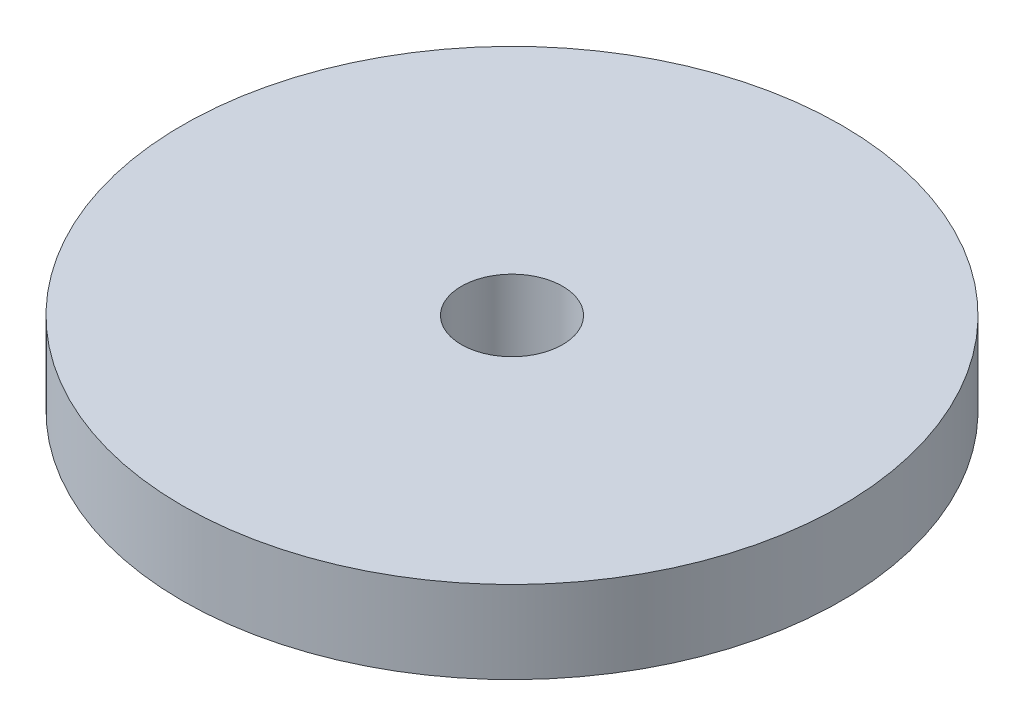
ISO-10303-21;
HEADER;
FILE_DESCRIPTION(('STEP AP214'),'2;1');
FILE_NAME('part.step','',(''),(''),'','','');
FILE_SCHEMA(('AUTOMOTIVE_DESIGN { 1 0 10303 214 1 1 1 1 }'));
ENDSEC;
DATA;
#1=APPLICATION_CONTEXT('core data for automotive mechanical design processes');
#2=APPLICATION_PROTOCOL_DEFINITION('international standard','automotive_design',2000,#1);
#3=PRODUCT_CONTEXT('',#1,'mechanical');
#4=PRODUCT('Part','Part','',(#3));
#5=PRODUCT_RELATED_PRODUCT_CATEGORY('part','',(#4));
#6=PRODUCT_DEFINITION_FORMATION('','',#4);
#7=PRODUCT_DEFINITION_CONTEXT('part definition',#1,'design');
#8=PRODUCT_DEFINITION('design','',#6,#7);
#9=PRODUCT_DEFINITION_SHAPE('','',#8);
#10=(LENGTH_UNIT() NAMED_UNIT(*) SI_UNIT(.MILLI.,.METRE.));
#11=(NAMED_UNIT(*) PLANE_ANGLE_UNIT() SI_UNIT($,.RADIAN.));
#12=(NAMED_UNIT(*) SI_UNIT($,.STERADIAN.) SOLID_ANGLE_UNIT());
#13=UNCERTAINTY_MEASURE_WITH_UNIT(LENGTH_MEASURE(1.E-05),#10,'distance_accuracy_value','');
#14=(GEOMETRIC_REPRESENTATION_CONTEXT(3) GLOBAL_UNCERTAINTY_ASSIGNED_CONTEXT((#13)) GLOBAL_UNIT_ASSIGNED_CONTEXT((#10,
#11,#12)) REPRESENTATION_CONTEXT('',''));
#15=CARTESIAN_POINT('',(0.,0.,0.));
#16=DIRECTION('',(0.,0.,1.));
#17=DIRECTION('',(1.,0.,0.));
#18=AXIS2_PLACEMENT_3D('',#15,#16,#17);
#19=CARTESIAN_POINT('',(0.,4.,0.));
#20=DIRECTION('',(0.,-1.,0.));
#21=DIRECTION('',(0.,0.,-1.));
#22=AXIS2_PLACEMENT_3D('',#19,#20,#21);
#23=CYLINDRICAL_SURFACE('',#22,14.);
#24=CARTESIAN_POINT('',(0.,4.,0.));
#25=DIRECTION('',(0.,1.,0.));
#26=DIRECTION('',(0.,0.,1.));
#27=AXIS2_PLACEMENT_3D('',#24,#25,#26);
#28=CIRCLE('',#27,14.);
#29=CARTESIAN_POINT('',(0.,4.,14.));
#30=VERTEX_POINT('',#29);
#31=EDGE_CURVE('E10',#30,#30,#28,.T.);
#32=ORIENTED_EDGE('',*,*,#31,.F.);
#33=EDGE_LOOP('',(#32));
#34=FACE_BOUND('',#33,.T.);
#35=CARTESIAN_POINT('',(0.,0.5,0.));
#36=DIRECTION('',(0.,-1.,0.));
#37=DIRECTION('',(0.,0.,-1.));
#38=AXIS2_PLACEMENT_3D('',#35,#36,#37);
#39=CIRCLE('',#38,14.);
#40=CARTESIAN_POINT('',(0.,0.5,-14.));
#41=VERTEX_POINT('',#40);
#42=EDGE_CURVE('E43',#41,#41,#39,.T.);
#43=ORIENTED_EDGE('',*,*,#42,.F.);
#44=EDGE_LOOP('',(#43));
#45=FACE_BOUND('',#44,.T.);
#46=ADVANCED_FACE('F37',(#34,#45),#23,.T.);
#47=CARTESIAN_POINT('',(0.,4.,0.));
#48=DIRECTION('',(0.,1.,0.));
#49=DIRECTION('',(0.,0.,1.));
#50=AXIS2_PLACEMENT_3D('',#47,#48,#49);
#51=PLANE('',#50);
#52=CARTESIAN_POINT('',(0.,4.,0.));
#53=DIRECTION('',(0.,1.,0.));
#54=DIRECTION('',(0.,0.,1.));
#55=AXIS2_PLACEMENT_3D('',#52,#53,#54);
#56=CIRCLE('',#55,2.15);
#57=CARTESIAN_POINT('',(0.,4.,2.15));
#58=VERTEX_POINT('',#57);
#59=EDGE_CURVE('E59',#58,#58,#56,.T.);
#60=ORIENTED_EDGE('',*,*,#59,.F.);
#61=EDGE_LOOP('',(#60));
#62=FACE_BOUND('',#61,.T.);
#63=ORIENTED_EDGE('',*,*,#31,.T.);
#64=EDGE_LOOP('',(#63));
#65=FACE_BOUND('',#64,.T.);
#66=ADVANCED_FACE('F65',(#62,#65),#51,.T.);
#67=CARTESIAN_POINT('',(0.,0.5,0.));
#68=DIRECTION('',(0.,-1.,0.));
#69=DIRECTION('',(0.,0.,-1.));
#70=AXIS2_PLACEMENT_3D('',#67,#68,#69);
#71=PLANE('',#70);
#72=CARTESIAN_POINT('',(0.,0.5,0.));
#73=DIRECTION('',(0.,-1.,0.));
#74=DIRECTION('',(0.,0.,-1.));
#75=AXIS2_PLACEMENT_3D('',#72,#73,#74);
#76=CIRCLE('',#75,6.5);
#77=CARTESIAN_POINT('',(0.,0.5,-6.5));
#78=VERTEX_POINT('',#77);
#79=EDGE_CURVE('E47',#78,#78,#76,.T.);
#80=ORIENTED_EDGE('',*,*,#79,.F.);
#81=EDGE_LOOP('',(#80));
#82=FACE_BOUND('',#81,.T.);
#83=ORIENTED_EDGE('',*,*,#42,.T.);
#84=EDGE_LOOP('',(#83));
#85=FACE_BOUND('',#84,.T.);
#86=ADVANCED_FACE('F67',(#82,#85),#71,.T.);
#87=CARTESIAN_POINT('',(0.,0.5,0.));
#88=DIRECTION('',(0.,-1.,0.));
#89=DIRECTION('',(0.,0.,-1.));
#90=AXIS2_PLACEMENT_3D('',#87,#88,#89);
#91=CYLINDRICAL_SURFACE('',#90,6.5);
#92=ORIENTED_EDGE('',*,*,#79,.T.);
#93=EDGE_LOOP('',(#92));
#94=FACE_BOUND('',#93,.T.);
#95=CARTESIAN_POINT('',(0.,0.,0.));
#96=DIRECTION('',(0.,-1.,0.));
#97=DIRECTION('',(0.,0.,-1.));
#98=AXIS2_PLACEMENT_3D('',#95,#96,#97);
#99=CIRCLE('',#98,6.5);
#100=CARTESIAN_POINT('',(0.,0.,-6.5));
#101=VERTEX_POINT('',#100);
#102=EDGE_CURVE('E51',#101,#101,#99,.T.);
#103=ORIENTED_EDGE('',*,*,#102,.F.);
#104=EDGE_LOOP('',(#103));
#105=FACE_BOUND('',#104,.T.);
#106=ADVANCED_FACE('F74',(#94,#105),#91,.T.);
#107=CARTESIAN_POINT('',(0.,0.,0.));
#108=DIRECTION('',(0.,1.,0.));
#109=DIRECTION('',(0.,0.,1.));
#110=AXIS2_PLACEMENT_3D('',#107,#108,#109);
#111=PLANE('',#110);
#112=CARTESIAN_POINT('',(0.,0.,0.));
#113=DIRECTION('',(0.,1.,0.));
#114=DIRECTION('',(0.,0.,1.));
#115=AXIS2_PLACEMENT_3D('',#112,#113,#114);
#116=CIRCLE('',#115,2.15);
#117=CARTESIAN_POINT('',(0.,0.,2.15));
#118=VERTEX_POINT('',#117);
#119=EDGE_CURVE('E55',#118,#118,#116,.F.);
#120=ORIENTED_EDGE('',*,*,#119,.F.);
#121=EDGE_LOOP('',(#120));
#122=FACE_BOUND('',#121,.T.);
#123=ORIENTED_EDGE('',*,*,#102,.T.);
#124=EDGE_LOOP('',(#123));
#125=FACE_BOUND('',#124,.T.);
#126=ADVANCED_FACE('F80',(#122,#125),#111,.F.);
#127=CARTESIAN_POINT('',(0.,-6.08111831820431,0.));
#128=DIRECTION('',(0.,1.,0.));
#129=DIRECTION('',(0.,0.,1.));
#130=AXIS2_PLACEMENT_3D('',#127,#128,#129);
#131=CYLINDRICAL_SURFACE('',#130,2.15);
#132=ORIENTED_EDGE('',*,*,#119,.T.);
#133=EDGE_LOOP('',(#132));
#134=FACE_BOUND('',#133,.T.);
#135=ORIENTED_EDGE('',*,*,#59,.T.);
#136=EDGE_LOOP('',(#135));
#137=FACE_BOUND('',#136,.T.);
#138=ADVANCED_FACE('F63',(#134,#137),#131,.F.);
#139=CLOSED_SHELL('',(#46,#66,#86,#106,#126,#138));
#140=MANIFOLD_SOLID_BREP('B2',#139);
#141=ADVANCED_BREP_SHAPE_REPRESENTATION('',(#18,#140),#14);
#142=SHAPE_DEFINITION_REPRESENTATION(#9,#141);
ENDSEC;
END-ISO-10303-21;
